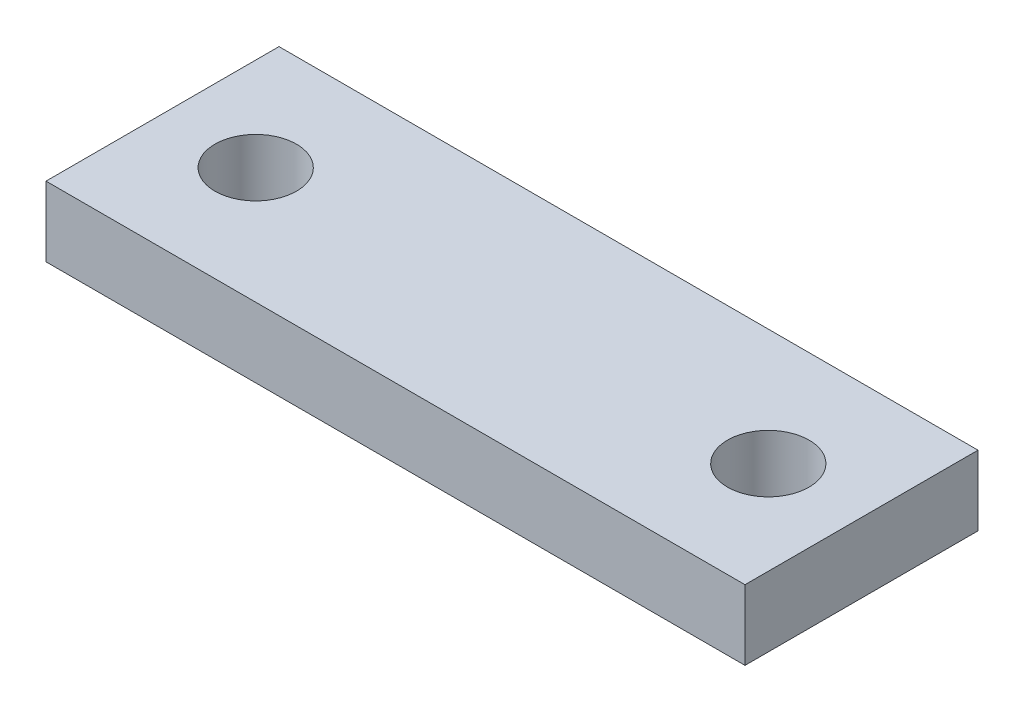
ISO-10303-21;
HEADER;
FILE_DESCRIPTION(('STEP AP214'),'2;1');
FILE_NAME('part.step','',(''),(''),'','','');
FILE_SCHEMA(('AUTOMOTIVE_DESIGN { 1 0 10303 214 1 1 1 1 }'));
ENDSEC;
DATA;
#1=APPLICATION_CONTEXT('core data for automotive mechanical design processes');
#2=APPLICATION_PROTOCOL_DEFINITION('international standard','automotive_design',2000,#1);
#3=PRODUCT_CONTEXT('',#1,'mechanical');
#4=PRODUCT('Part','Part','',(#3));
#5=PRODUCT_RELATED_PRODUCT_CATEGORY('part','',(#4));
#6=PRODUCT_DEFINITION_FORMATION('','',#4);
#7=PRODUCT_DEFINITION_CONTEXT('part definition',#1,'design');
#8=PRODUCT_DEFINITION('design','',#6,#7);
#9=PRODUCT_DEFINITION_SHAPE('','',#8);
#10=(LENGTH_UNIT() NAMED_UNIT(*) SI_UNIT(.MILLI.,.METRE.));
#11=(NAMED_UNIT(*) PLANE_ANGLE_UNIT() SI_UNIT($,.RADIAN.));
#12=(NAMED_UNIT(*) SI_UNIT($,.STERADIAN.) SOLID_ANGLE_UNIT());
#13=UNCERTAINTY_MEASURE_WITH_UNIT(LENGTH_MEASURE(1.E-05),#10,'distance_accuracy_value','');
#14=(GEOMETRIC_REPRESENTATION_CONTEXT(3) GLOBAL_UNCERTAINTY_ASSIGNED_CONTEXT((#13)) GLOBAL_UNIT_ASSIGNED_CONTEXT((#10,
#11,#12)) REPRESENTATION_CONTEXT('',''));
#15=CARTESIAN_POINT('',(0.,0.,0.));
#16=DIRECTION('',(0.,0.,1.));
#17=DIRECTION('',(1.,0.,0.));
#18=AXIS2_PLACEMENT_3D('',#15,#16,#17);
#19=CARTESIAN_POINT('',(0.,3.,0.));
#20=DIRECTION('',(0.,1.,0.));
#21=DIRECTION('',(0.,0.,1.));
#22=AXIS2_PLACEMENT_3D('',#19,#20,#21);
#23=PLANE('',#22);
#24=CARTESIAN_POINT('',(4.,3.,-5.));
#25=DIRECTION('',(0.,1.,0.));
#26=DIRECTION('',(0.,0.,1.));
#27=AXIS2_PLACEMENT_3D('',#24,#25,#26);
#28=CIRCLE('',#27,1.75);
#29=CARTESIAN_POINT('',(4.,3.,-3.25));
#30=VERTEX_POINT('',#29);
#31=EDGE_CURVE('E100',#30,#30,#28,.T.);
#32=ORIENTED_EDGE('',*,*,#31,.F.);
#33=EDGE_LOOP('',(#32));
#34=FACE_BOUND('',#33,.T.);
#35=DIRECTION('',(1.,0.,0.));
#36=VECTOR('',#35,1.);
#37=CARTESIAN_POINT('',(0.,3.,0.));
#38=LINE('',#37,#36);
#39=CARTESIAN_POINT('',(0.,3.,0.));
#40=VERTEX_POINT('',#39);
#41=CARTESIAN_POINT('',(30.,3.,0.));
#42=VERTEX_POINT('',#41);
#43=EDGE_CURVE('E85',#40,#42,#38,.T.);
#44=ORIENTED_EDGE('',*,*,#43,.T.);
#45=DIRECTION('',(0.,0.,-1.));
#46=VECTOR('',#45,1.);
#47=CARTESIAN_POINT('',(30.,3.,0.));
#48=LINE('',#47,#46);
#49=CARTESIAN_POINT('',(30.,3.,-10.));
#50=VERTEX_POINT('',#49);
#51=EDGE_CURVE('E80',#42,#50,#48,.T.);
#52=ORIENTED_EDGE('',*,*,#51,.T.);
#53=DIRECTION('',(-1.,0.,0.));
#54=VECTOR('',#53,1.);
#55=CARTESIAN_POINT('',(0.,3.,-10.));
#56=LINE('',#55,#54);
#57=CARTESIAN_POINT('',(0.,3.,-10.));
#58=VERTEX_POINT('',#57);
#59=EDGE_CURVE('E83',#50,#58,#56,.T.);
#60=ORIENTED_EDGE('',*,*,#59,.T.);
#61=DIRECTION('',(0.,0.,1.));
#62=VECTOR('',#61,1.);
#63=CARTESIAN_POINT('',(0.,3.,0.));
#64=LINE('',#63,#62);
#65=EDGE_CURVE('E50',#58,#40,#64,.T.);
#66=ORIENTED_EDGE('',*,*,#65,.T.);
#67=EDGE_LOOP('',(#44,#52,#60,#66));
#68=FACE_BOUND('',#67,.T.);
#69=CARTESIAN_POINT('',(26.,3.,-5.));
#70=DIRECTION('',(0.,1.,0.));
#71=DIRECTION('',(0.,0.,1.));
#72=AXIS2_PLACEMENT_3D('',#69,#70,#71);
#73=CIRCLE('',#72,1.75);
#74=CARTESIAN_POINT('',(26.,3.,-3.25));
#75=VERTEX_POINT('',#74);
#76=EDGE_CURVE('E115',#75,#75,#73,.T.);
#77=ORIENTED_EDGE('',*,*,#76,.F.);
#78=EDGE_LOOP('',(#77));
#79=FACE_BOUND('',#78,.T.);
#80=ADVANCED_FACE('F33',(#34,#68,#79),#23,.T.);
#81=CARTESIAN_POINT('',(0.,0.,0.));
#82=DIRECTION('',(0.,1.,0.));
#83=DIRECTION('',(0.,0.,1.));
#84=AXIS2_PLACEMENT_3D('',#81,#82,#83);
#85=PLANE('',#84);
#86=CARTESIAN_POINT('',(4.,0.,-5.));
#87=DIRECTION('',(0.,1.,0.));
#88=DIRECTION('',(0.,0.,1.));
#89=AXIS2_PLACEMENT_3D('',#86,#87,#88);
#90=CIRCLE('',#89,1.75);
#91=CARTESIAN_POINT('',(4.,0.,-3.25));
#92=VERTEX_POINT('',#91);
#93=EDGE_CURVE('E112',#92,#92,#90,.T.);
#94=ORIENTED_EDGE('',*,*,#93,.T.);
#95=EDGE_LOOP('',(#94));
#96=FACE_BOUND('',#95,.T.);
#97=DIRECTION('',(1.,0.,0.));
#98=VECTOR('',#97,1.);
#99=CARTESIAN_POINT('',(0.,0.,0.));
#100=LINE('',#99,#98);
#101=CARTESIAN_POINT('',(0.,0.,0.));
#102=VERTEX_POINT('',#101);
#103=CARTESIAN_POINT('',(30.,0.,0.));
#104=VERTEX_POINT('',#103);
#105=EDGE_CURVE('E97',#102,#104,#100,.T.);
#106=ORIENTED_EDGE('',*,*,#105,.F.);
#107=DIRECTION('',(0.,0.,1.));
#108=VECTOR('',#107,1.);
#109=CARTESIAN_POINT('',(0.,0.,0.));
#110=LINE('',#109,#108);
#111=CARTESIAN_POINT('',(0.,0.,-10.));
#112=VERTEX_POINT('',#111);
#113=EDGE_CURVE('E73',#112,#102,#110,.T.);
#114=ORIENTED_EDGE('',*,*,#113,.F.);
#115=DIRECTION('',(-1.,0.,0.));
#116=VECTOR('',#115,1.);
#117=CARTESIAN_POINT('',(0.,0.,-10.));
#118=LINE('',#117,#116);
#119=CARTESIAN_POINT('',(30.,0.,-10.));
#120=VERTEX_POINT('',#119);
#121=EDGE_CURVE('E67',#120,#112,#118,.T.);
#122=ORIENTED_EDGE('',*,*,#121,.F.);
#123=DIRECTION('',(0.,0.,-1.));
#124=VECTOR('',#123,1.);
#125=CARTESIAN_POINT('',(30.,0.,0.));
#126=LINE('',#125,#124);
#127=EDGE_CURVE('E89',#104,#120,#126,.T.);
#128=ORIENTED_EDGE('',*,*,#127,.F.);
#129=EDGE_LOOP('',(#106,#114,#122,#128));
#130=FACE_BOUND('',#129,.T.);
#131=CARTESIAN_POINT('',(26.,0.,-5.));
#132=DIRECTION('',(0.,1.,0.));
#133=DIRECTION('',(0.,0.,1.));
#134=AXIS2_PLACEMENT_3D('',#131,#132,#133);
#135=CIRCLE('',#134,1.75);
#136=CARTESIAN_POINT('',(26.,0.,-3.25));
#137=VERTEX_POINT('',#136);
#138=EDGE_CURVE('E118',#137,#137,#135,.T.);
#139=ORIENTED_EDGE('',*,*,#138,.T.);
#140=EDGE_LOOP('',(#139));
#141=FACE_BOUND('',#140,.T.);
#142=ADVANCED_FACE('F108',(#96,#130,#141),#85,.F.);
#143=CARTESIAN_POINT('',(0.,3.,0.));
#144=DIRECTION('',(0.,0.,-1.));
#145=DIRECTION('',(-1.,0.,0.));
#146=AXIS2_PLACEMENT_3D('',#143,#144,#145);
#147=PLANE('',#146);
#148=ORIENTED_EDGE('',*,*,#105,.T.);
#149=DIRECTION('',(0.,-1.,0.));
#150=VECTOR('',#149,1.);
#151=CARTESIAN_POINT('',(30.,3.,0.));
#152=LINE('',#151,#150);
#153=EDGE_CURVE('E11',#42,#104,#152,.T.);
#154=ORIENTED_EDGE('',*,*,#153,.F.);
#155=ORIENTED_EDGE('',*,*,#43,.F.);
#156=DIRECTION('',(0.,-1.,0.));
#157=VECTOR('',#156,1.);
#158=CARTESIAN_POINT('',(0.,3.,0.));
#159=LINE('',#158,#157);
#160=EDGE_CURVE('E93',#40,#102,#159,.T.);
#161=ORIENTED_EDGE('',*,*,#160,.T.);
#162=EDGE_LOOP('',(#148,#154,#155,#161));
#163=FACE_BOUND('',#162,.T.);
#164=ADVANCED_FACE('F35',(#163),#147,.F.);
#165=CARTESIAN_POINT('',(30.,3.,0.));
#166=DIRECTION('',(-1.,0.,0.));
#167=DIRECTION('',(0.,0.,1.));
#168=AXIS2_PLACEMENT_3D('',#165,#166,#167);
#169=PLANE('',#168);
#170=ORIENTED_EDGE('',*,*,#127,.T.);
#171=DIRECTION('',(0.,-1.,0.));
#172=VECTOR('',#171,1.);
#173=CARTESIAN_POINT('',(30.,3.,-10.));
#174=LINE('',#173,#172);
#175=EDGE_CURVE('E42',#50,#120,#174,.T.);
#176=ORIENTED_EDGE('',*,*,#175,.F.);
#177=ORIENTED_EDGE('',*,*,#51,.F.);
#178=ORIENTED_EDGE('',*,*,#153,.T.);
#179=EDGE_LOOP('',(#170,#176,#177,#178));
#180=FACE_BOUND('',#179,.T.);
#181=ADVANCED_FACE('F88',(#180),#169,.F.);
#182=CARTESIAN_POINT('',(0.,3.,-10.));
#183=DIRECTION('',(0.,0.,1.));
#184=DIRECTION('',(1.,0.,0.));
#185=AXIS2_PLACEMENT_3D('',#182,#183,#184);
#186=PLANE('',#185);
#187=ORIENTED_EDGE('',*,*,#121,.T.);
#188=DIRECTION('',(0.,-1.,0.));
#189=VECTOR('',#188,1.);
#190=CARTESIAN_POINT('',(0.,3.,-10.));
#191=LINE('',#190,#189);
#192=EDGE_CURVE('E90',#58,#112,#191,.T.);
#193=ORIENTED_EDGE('',*,*,#192,.F.);
#194=ORIENTED_EDGE('',*,*,#59,.F.);
#195=ORIENTED_EDGE('',*,*,#175,.T.);
#196=EDGE_LOOP('',(#187,#193,#194,#195));
#197=FACE_BOUND('',#196,.T.);
#198=ADVANCED_FACE('F91',(#197),#186,.F.);
#199=CARTESIAN_POINT('',(0.,3.,0.));
#200=DIRECTION('',(1.,0.,0.));
#201=DIRECTION('',(0.,0.,-1.));
#202=AXIS2_PLACEMENT_3D('',#199,#200,#201);
#203=PLANE('',#202);
#204=ORIENTED_EDGE('',*,*,#113,.T.);
#205=ORIENTED_EDGE('',*,*,#160,.F.);
#206=ORIENTED_EDGE('',*,*,#65,.F.);
#207=ORIENTED_EDGE('',*,*,#192,.T.);
#208=EDGE_LOOP('',(#204,#205,#206,#207));
#209=FACE_BOUND('',#208,.T.);
#210=ADVANCED_FACE('F105',(#209),#203,.F.);
#211=CARTESIAN_POINT('',(4.,3.,-5.));
#212=DIRECTION('',(0.,-1.,0.));
#213=DIRECTION('',(0.,0.,-1.));
#214=AXIS2_PLACEMENT_3D('',#211,#212,#213);
#215=CYLINDRICAL_SURFACE('',#214,1.75);
#216=ORIENTED_EDGE('',*,*,#31,.T.);
#217=EDGE_LOOP('',(#216));
#218=FACE_BOUND('',#217,.T.);
#219=ORIENTED_EDGE('',*,*,#93,.F.);
#220=EDGE_LOOP('',(#219));
#221=FACE_BOUND('',#220,.T.);
#222=ADVANCED_FACE('F136',(#218,#221),#215,.F.);
#223=CARTESIAN_POINT('',(26.,3.,-5.));
#224=DIRECTION('',(0.,-1.,0.));
#225=DIRECTION('',(0.,0.,-1.));
#226=AXIS2_PLACEMENT_3D('',#223,#224,#225);
#227=CYLINDRICAL_SURFACE('',#226,1.75);
#228=ORIENTED_EDGE('',*,*,#76,.T.);
#229=EDGE_LOOP('',(#228));
#230=FACE_BOUND('',#229,.T.);
#231=ORIENTED_EDGE('',*,*,#138,.F.);
#232=EDGE_LOOP('',(#231));
#233=FACE_BOUND('',#232,.T.);
#234=ADVANCED_FACE('F124',(#230,#233),#227,.F.);
#235=CLOSED_SHELL('',(#80,#142,#164,#181,#198,#210,#222,#234));
#236=MANIFOLD_SOLID_BREP('B2',#235);
#237=ADVANCED_BREP_SHAPE_REPRESENTATION('',(#18,#236),#14);
#238=SHAPE_DEFINITION_REPRESENTATION(#9,#237);
ENDSEC;
END-ISO-10303-21;
